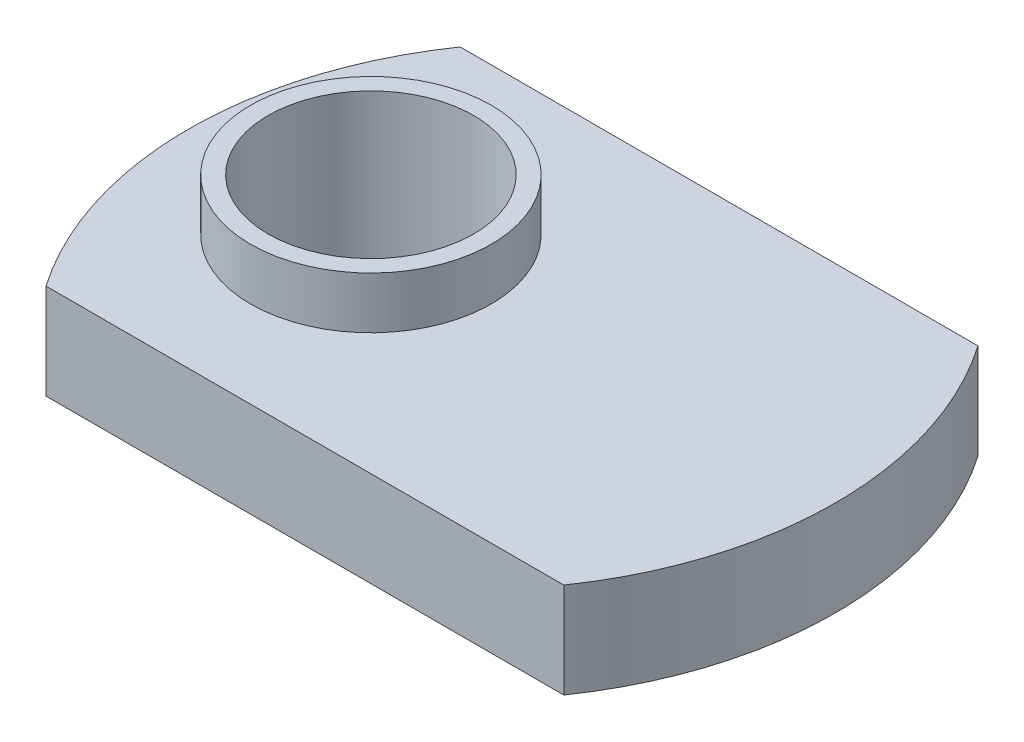
ISO-10303-21;
HEADER;
FILE_DESCRIPTION(('STEP AP214'),'2;1');
FILE_NAME('part.step','',(''),(''),'','','');
FILE_SCHEMA(('AUTOMOTIVE_DESIGN { 1 0 10303 214 1 1 1 1 }'));
ENDSEC;
DATA;
#1=APPLICATION_CONTEXT('core data for automotive mechanical design processes');
#2=APPLICATION_PROTOCOL_DEFINITION('international standard','automotive_design',2000,#1);
#3=PRODUCT_CONTEXT('',#1,'mechanical');
#4=PRODUCT('Part','Part','',(#3));
#5=PRODUCT_RELATED_PRODUCT_CATEGORY('part','',(#4));
#6=PRODUCT_DEFINITION_FORMATION('','',#4);
#7=PRODUCT_DEFINITION_CONTEXT('part definition',#1,'design');
#8=PRODUCT_DEFINITION('design','',#6,#7);
#9=PRODUCT_DEFINITION_SHAPE('','',#8);
#10=(LENGTH_UNIT() NAMED_UNIT(*) SI_UNIT(.MILLI.,.METRE.));
#11=(NAMED_UNIT(*) PLANE_ANGLE_UNIT() SI_UNIT($,.RADIAN.));
#12=(NAMED_UNIT(*) SI_UNIT($,.STERADIAN.) SOLID_ANGLE_UNIT());
#13=UNCERTAINTY_MEASURE_WITH_UNIT(LENGTH_MEASURE(1.E-05),#10,'distance_accuracy_value','');
#14=(GEOMETRIC_REPRESENTATION_CONTEXT(3) GLOBAL_UNCERTAINTY_ASSIGNED_CONTEXT((#13)) GLOBAL_UNIT_ASSIGNED_CONTEXT((#10,
#11,#12)) REPRESENTATION_CONTEXT('',''));
#15=CARTESIAN_POINT('',(0.,0.,0.));
#16=DIRECTION('',(0.,0.,1.));
#17=DIRECTION('',(1.,0.,0.));
#18=AXIS2_PLACEMENT_3D('',#15,#16,#17);
#19=CARTESIAN_POINT('',(11.55,3.68,-8.));
#20=DIRECTION('',(0.,-1.,0.));
#21=DIRECTION('',(0.,0.,-1.));
#22=AXIS2_PLACEMENT_3D('',#19,#20,#21);
#23=PLANE('',#22);
#24=CARTESIAN_POINT('',(11.55,3.68,-8.));
#25=DIRECTION('',(0.,1.,0.));
#26=DIRECTION('',(0.,0.,-1.));
#27=AXIS2_PLACEMENT_3D('',#24,#25,#26);
#28=CIRCLE('',#27,14.05);
#29=CARTESIAN_POINT('',(0.,3.68,-16.));
#30=VERTEX_POINT('',#29);
#31=CARTESIAN_POINT('',(0.,3.68,0.));
#32=VERTEX_POINT('',#31);
#33=EDGE_CURVE('E85',#30,#32,#28,.T.);
#34=ORIENTED_EDGE('',*,*,#33,.T.);
#35=DIRECTION('',(1.,0.,0.));
#36=VECTOR('',#35,1.);
#37=CARTESIAN_POINT('',(0.,3.68,0.));
#38=LINE('',#37,#36);
#39=CARTESIAN_POINT('',(20.,3.68,0.));
#40=VERTEX_POINT('',#39);
#41=EDGE_CURVE('E80',#32,#40,#38,.T.);
#42=ORIENTED_EDGE('',*,*,#41,.T.);
#43=CARTESIAN_POINT('',(8.45000000000001,3.68,-8.));
#44=DIRECTION('',(0.,1.,0.));
#45=DIRECTION('',(0.,0.,-1.));
#46=AXIS2_PLACEMENT_3D('',#43,#44,#45);
#47=CIRCLE('',#46,14.05);
#48=CARTESIAN_POINT('',(20.,3.68,-16.));
#49=VERTEX_POINT('',#48);
#50=EDGE_CURVE('E83',#40,#49,#47,.T.);
#51=ORIENTED_EDGE('',*,*,#50,.T.);
#52=DIRECTION('',(-1.,0.,0.));
#53=VECTOR('',#52,1.);
#54=CARTESIAN_POINT('',(0.,3.68,-16.));
#55=LINE('',#54,#53);
#56=EDGE_CURVE('E49',#49,#30,#55,.T.);
#57=ORIENTED_EDGE('',*,*,#56,.T.);
#58=EDGE_LOOP('',(#34,#42,#51,#57));
#59=FACE_BOUND('',#58,.T.);
#60=CARTESIAN_POINT('',(4.54999999999999,3.68,-8.));
#61=DIRECTION('',(0.,-1.,0.));
#62=DIRECTION('',(0.,0.,-1.));
#63=AXIS2_PLACEMENT_3D('',#60,#61,#62);
#64=CIRCLE('',#63,4.65);
#65=CARTESIAN_POINT('',(4.54999999999999,3.68,-12.65));
#66=VERTEX_POINT('',#65);
#67=EDGE_CURVE('E11',#66,#66,#64,.F.);
#68=ORIENTED_EDGE('',*,*,#67,.F.);
#69=EDGE_LOOP('',(#68));
#70=FACE_BOUND('',#69,.T.);
#71=ADVANCED_FACE('F32',(#59,#70),#23,.F.);
#72=CARTESIAN_POINT('',(11.55,0.,-8.));
#73=DIRECTION('',(0.,-1.,0.));
#74=DIRECTION('',(0.,0.,-1.));
#75=AXIS2_PLACEMENT_3D('',#72,#73,#74);
#76=PLANE('',#75);
#77=CARTESIAN_POINT('',(11.55,0.,-8.));
#78=DIRECTION('',(0.,1.,0.));
#79=DIRECTION('',(0.,0.,-1.));
#80=AXIS2_PLACEMENT_3D('',#77,#78,#79);
#81=CIRCLE('',#80,14.05);
#82=CARTESIAN_POINT('',(0.,0.,-16.));
#83=VERTEX_POINT('',#82);
#84=CARTESIAN_POINT('',(0.,0.,0.));
#85=VERTEX_POINT('',#84);
#86=EDGE_CURVE('E99',#83,#85,#81,.T.);
#87=ORIENTED_EDGE('',*,*,#86,.F.);
#88=DIRECTION('',(-1.,0.,0.));
#89=VECTOR('',#88,1.);
#90=CARTESIAN_POINT('',(0.,0.,-16.));
#91=LINE('',#90,#89);
#92=CARTESIAN_POINT('',(20.,0.,-16.));
#93=VERTEX_POINT('',#92);
#94=EDGE_CURVE('E72',#93,#83,#91,.T.);
#95=ORIENTED_EDGE('',*,*,#94,.F.);
#96=CARTESIAN_POINT('',(8.45000000000001,0.,-8.));
#97=DIRECTION('',(0.,1.,0.));
#98=DIRECTION('',(0.,0.,-1.));
#99=AXIS2_PLACEMENT_3D('',#96,#97,#98);
#100=CIRCLE('',#99,14.05);
#101=CARTESIAN_POINT('',(20.,0.,0.));
#102=VERTEX_POINT('',#101);
#103=EDGE_CURVE('E66',#102,#93,#100,.T.);
#104=ORIENTED_EDGE('',*,*,#103,.F.);
#105=DIRECTION('',(1.,0.,0.));
#106=VECTOR('',#105,1.);
#107=CARTESIAN_POINT('',(0.,0.,0.));
#108=LINE('',#107,#106);
#109=EDGE_CURVE('E90',#85,#102,#108,.T.);
#110=ORIENTED_EDGE('',*,*,#109,.F.);
#111=EDGE_LOOP('',(#87,#95,#104,#110));
#112=FACE_BOUND('',#111,.T.);
#113=CARTESIAN_POINT('',(4.54999999999999,0.,-8.));
#114=DIRECTION('',(0.,1.,0.));
#115=DIRECTION('',(0.,0.,1.));
#116=AXIS2_PLACEMENT_3D('',#113,#114,#115);
#117=CIRCLE('',#116,3.96875);
#118=CARTESIAN_POINT('',(4.54999999999999,0.,-4.03125));
#119=VERTEX_POINT('',#118);
#120=EDGE_CURVE('E102',#119,#119,#117,.T.);
#121=ORIENTED_EDGE('',*,*,#120,.T.);
#122=EDGE_LOOP('',(#121));
#123=FACE_BOUND('',#122,.T.);
#124=ADVANCED_FACE('F110',(#112,#123),#76,.T.);
#125=CARTESIAN_POINT('',(11.55,3.68,-8.));
#126=DIRECTION('',(0.,-1.,0.));
#127=DIRECTION('',(0.,0.,-1.));
#128=AXIS2_PLACEMENT_3D('',#125,#126,#127);
#129=CYLINDRICAL_SURFACE('',#128,14.05);
#130=ORIENTED_EDGE('',*,*,#86,.T.);
#131=DIRECTION('',(0.,-1.,0.));
#132=VECTOR('',#131,1.);
#133=CARTESIAN_POINT('',(0.,3.68,0.));
#134=LINE('',#133,#132);
#135=EDGE_CURVE('E41',#32,#85,#134,.T.);
#136=ORIENTED_EDGE('',*,*,#135,.F.);
#137=ORIENTED_EDGE('',*,*,#33,.F.);
#138=DIRECTION('',(0.,-1.,0.));
#139=VECTOR('',#138,1.);
#140=CARTESIAN_POINT('',(0.,3.68,-16.));
#141=LINE('',#140,#139);
#142=EDGE_CURVE('E95',#30,#83,#141,.T.);
#143=ORIENTED_EDGE('',*,*,#142,.T.);
#144=EDGE_LOOP('',(#130,#136,#137,#143));
#145=FACE_BOUND('',#144,.T.);
#146=ADVANCED_FACE('F34',(#145),#129,.T.);
#147=CARTESIAN_POINT('',(0.,3.68,0.));
#148=DIRECTION('',(0.,0.,-1.));
#149=DIRECTION('',(-1.,0.,0.));
#150=AXIS2_PLACEMENT_3D('',#147,#148,#149);
#151=PLANE('',#150);
#152=ORIENTED_EDGE('',*,*,#109,.T.);
#153=DIRECTION('',(0.,-1.,0.));
#154=VECTOR('',#153,1.);
#155=CARTESIAN_POINT('',(20.,3.68,0.));
#156=LINE('',#155,#154);
#157=EDGE_CURVE('E88',#40,#102,#156,.T.);
#158=ORIENTED_EDGE('',*,*,#157,.F.);
#159=ORIENTED_EDGE('',*,*,#41,.F.);
#160=ORIENTED_EDGE('',*,*,#135,.T.);
#161=EDGE_LOOP('',(#152,#158,#159,#160));
#162=FACE_BOUND('',#161,.T.);
#163=ADVANCED_FACE('F89',(#162),#151,.F.);
#164=CARTESIAN_POINT('',(8.45000000000001,3.68,-8.));
#165=DIRECTION('',(0.,-1.,0.));
#166=DIRECTION('',(0.,0.,-1.));
#167=AXIS2_PLACEMENT_3D('',#164,#165,#166);
#168=CYLINDRICAL_SURFACE('',#167,14.05);
#169=ORIENTED_EDGE('',*,*,#103,.T.);
#170=DIRECTION('',(0.,-1.,0.));
#171=VECTOR('',#170,1.);
#172=CARTESIAN_POINT('',(20.,3.68,-16.));
#173=LINE('',#172,#171);
#174=EDGE_CURVE('E91',#49,#93,#173,.T.);
#175=ORIENTED_EDGE('',*,*,#174,.F.);
#176=ORIENTED_EDGE('',*,*,#50,.F.);
#177=ORIENTED_EDGE('',*,*,#157,.T.);
#178=EDGE_LOOP('',(#169,#175,#176,#177));
#179=FACE_BOUND('',#178,.T.);
#180=ADVANCED_FACE('F93',(#179),#168,.T.);
#181=CARTESIAN_POINT('',(0.,3.68,-16.));
#182=DIRECTION('',(0.,0.,1.));
#183=DIRECTION('',(1.,0.,0.));
#184=AXIS2_PLACEMENT_3D('',#181,#182,#183);
#185=PLANE('',#184);
#186=ORIENTED_EDGE('',*,*,#94,.T.);
#187=ORIENTED_EDGE('',*,*,#142,.F.);
#188=ORIENTED_EDGE('',*,*,#56,.F.);
#189=ORIENTED_EDGE('',*,*,#174,.T.);
#190=EDGE_LOOP('',(#186,#187,#188,#189));
#191=FACE_BOUND('',#190,.T.);
#192=ADVANCED_FACE('F139',(#191),#185,.F.);
#193=CARTESIAN_POINT('',(4.54999999999999,3.68,-8.));
#194=DIRECTION('',(0.,-1.,0.));
#195=DIRECTION('',(0.,0.,-1.));
#196=AXIS2_PLACEMENT_3D('',#193,#194,#195);
#197=CYLINDRICAL_SURFACE('',#196,3.96875);
#198=ORIENTED_EDGE('',*,*,#120,.F.);
#199=EDGE_LOOP('',(#198));
#200=FACE_BOUND('',#199,.T.);
#201=CARTESIAN_POINT('',(4.54999999999999,5.68,-8.));
#202=DIRECTION('',(0.,1.,0.));
#203=DIRECTION('',(0.,0.,1.));
#204=AXIS2_PLACEMENT_3D('',#201,#202,#203);
#205=CIRCLE('',#204,3.96875);
#206=CARTESIAN_POINT('',(4.54999999999999,5.68,-4.03125));
#207=VERTEX_POINT('',#206);
#208=EDGE_CURVE('E120',#207,#207,#205,.T.);
#209=ORIENTED_EDGE('',*,*,#208,.T.);
#210=EDGE_LOOP('',(#209));
#211=FACE_BOUND('',#210,.T.);
#212=ADVANCED_FACE('F126',(#200,#211),#197,.F.);
#213=CARTESIAN_POINT('',(4.54999999999999,5.68,-8.));
#214=DIRECTION('',(0.,1.,0.));
#215=DIRECTION('',(0.,0.,1.));
#216=AXIS2_PLACEMENT_3D('',#213,#214,#215);
#217=PLANE('',#216);
#218=CARTESIAN_POINT('',(4.54999999999999,5.68,-8.));
#219=DIRECTION('',(0.,1.,0.));
#220=DIRECTION('',(0.,0.,1.));
#221=AXIS2_PLACEMENT_3D('',#218,#219,#220);
#222=CIRCLE('',#221,4.65);
#223=CARTESIAN_POINT('',(4.54999999999999,5.68,-3.35));
#224=VERTEX_POINT('',#223);
#225=EDGE_CURVE('E117',#224,#224,#222,.T.);
#226=ORIENTED_EDGE('',*,*,#225,.T.);
#227=EDGE_LOOP('',(#226));
#228=FACE_BOUND('',#227,.T.);
#229=ORIENTED_EDGE('',*,*,#208,.F.);
#230=EDGE_LOOP('',(#229));
#231=FACE_BOUND('',#230,.T.);
#232=ADVANCED_FACE('F128',(#228,#231),#217,.T.);
#233=CARTESIAN_POINT('',(4.54999999999999,5.68,-8.));
#234=DIRECTION('',(0.,-1.,0.));
#235=DIRECTION('',(0.,0.,-1.));
#236=AXIS2_PLACEMENT_3D('',#233,#234,#235);
#237=CYLINDRICAL_SURFACE('',#236,4.65);
#238=ORIENTED_EDGE('',*,*,#225,.F.);
#239=EDGE_LOOP('',(#238));
#240=FACE_BOUND('',#239,.T.);
#241=ORIENTED_EDGE('',*,*,#67,.T.);
#242=EDGE_LOOP('',(#241));
#243=FACE_BOUND('',#242,.T.);
#244=ADVANCED_FACE('F130',(#240,#243),#237,.T.);
#245=CLOSED_SHELL('',(#71,#124,#146,#163,#180,#192,#212,#232,#244));
#246=MANIFOLD_SOLID_BREP('B2',#245);
#247=ADVANCED_BREP_SHAPE_REPRESENTATION('',(#18,#246),#14);
#248=SHAPE_DEFINITION_REPRESENTATION(#9,#247);
ENDSEC;
END-ISO-10303-21;
